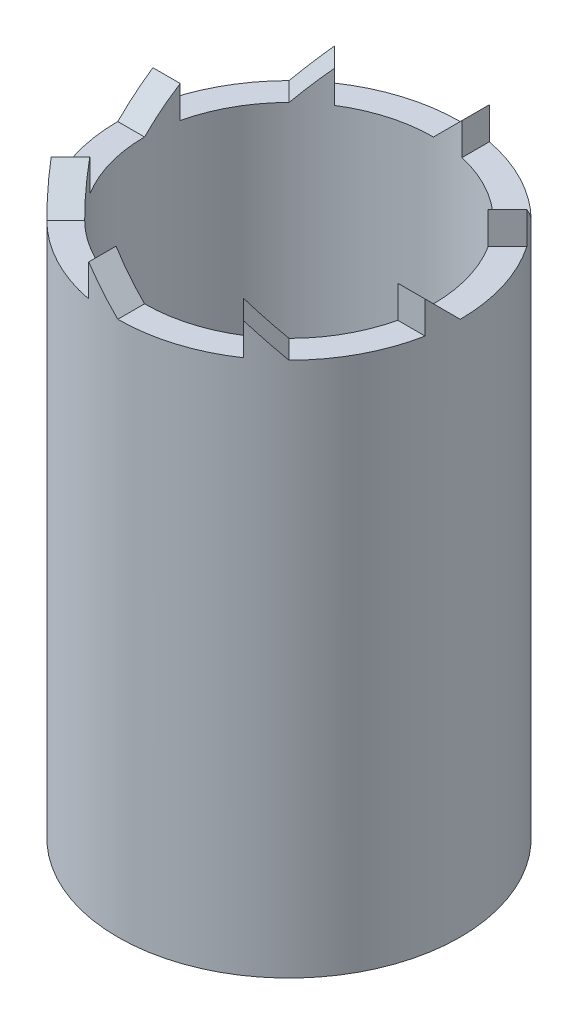
ISO-10303-21;
HEADER;
FILE_DESCRIPTION(('STEP AP214'),'2;1');
FILE_NAME('part.step','',(''),(''),'','','');
FILE_SCHEMA(('AUTOMOTIVE_DESIGN { 1 0 10303 214 1 1 1 1 }'));
ENDSEC;
DATA;
#1=APPLICATION_CONTEXT('core data for automotive mechanical design processes');
#2=APPLICATION_PROTOCOL_DEFINITION('international standard','automotive_design',2000,#1);
#3=PRODUCT_CONTEXT('',#1,'mechanical');
#4=PRODUCT('Part','Part','',(#3));
#5=PRODUCT_RELATED_PRODUCT_CATEGORY('part','',(#4));
#6=PRODUCT_DEFINITION_FORMATION('','',#4);
#7=PRODUCT_DEFINITION_CONTEXT('part definition',#1,'design');
#8=PRODUCT_DEFINITION('design','',#6,#7);
#9=PRODUCT_DEFINITION_SHAPE('','',#8);
#10=(LENGTH_UNIT() NAMED_UNIT(*) SI_UNIT(.MILLI.,.METRE.));
#11=(NAMED_UNIT(*) PLANE_ANGLE_UNIT() SI_UNIT($,.RADIAN.));
#12=(NAMED_UNIT(*) SI_UNIT($,.STERADIAN.) SOLID_ANGLE_UNIT());
#13=UNCERTAINTY_MEASURE_WITH_UNIT(LENGTH_MEASURE(1.E-05),#10,'distance_accuracy_value','');
#14=(GEOMETRIC_REPRESENTATION_CONTEXT(3) GLOBAL_UNCERTAINTY_ASSIGNED_CONTEXT((#13)) GLOBAL_UNIT_ASSIGNED_CONTEXT((#10,
#11,#12)) REPRESENTATION_CONTEXT('',''));
#15=CARTESIAN_POINT('',(0.,0.,0.));
#16=DIRECTION('',(0.,0.,1.));
#17=DIRECTION('',(1.,0.,0.));
#18=AXIS2_PLACEMENT_3D('',#15,#16,#17);
#19=CARTESIAN_POINT('',(-1.5,26.5,8.25));
#20=DIRECTION('',(1.,0.,0.));
#21=DIRECTION('',(0.,0.,-1.));
#22=AXIS2_PLACEMENT_3D('',#19,#20,#21);
#23=PLANE('',#22);
#24=DIRECTION('',(0.,-1.,0.));
#25=VECTOR('',#24,1.);
#26=CARTESIAN_POINT('',(-1.5,40.,6.5812232905441));
#27=LINE('',#26,#25);
#28=CARTESIAN_POINT('',(-1.5,25.,6.5812232905441));
#29=VERTEX_POINT('',#28);
#30=CARTESIAN_POINT('',(-1.5,26.5,6.5812232905441));
#31=VERTEX_POINT('',#30);
#32=EDGE_CURVE('E364',#29,#31,#27,.F.);
#33=ORIENTED_EDGE('',*,*,#32,.F.);
#34=DIRECTION('',(0.,0.,1.));
#35=VECTOR('',#34,1.);
#36=CARTESIAN_POINT('',(-1.5,25.,8.25));
#37=LINE('',#36,#35);
#38=CARTESIAN_POINT('',(-1.5,25.,7.85811682275086));
#39=VERTEX_POINT('',#38);
#40=EDGE_CURVE('E47',#29,#39,#37,.T.);
#41=ORIENTED_EDGE('',*,*,#40,.T.);
#42=DIRECTION('',(0.,-1.,0.));
#43=VECTOR('',#42,1.);
#44=CARTESIAN_POINT('',(-1.5,35.,7.85811682275086));
#45=LINE('',#44,#43);
#46=CARTESIAN_POINT('',(-1.5,26.5,7.85811682275086));
#47=VERTEX_POINT('',#46);
#48=EDGE_CURVE('E347',#47,#39,#45,.T.);
#49=ORIENTED_EDGE('',*,*,#48,.F.);
#50=DIRECTION('',(0.,0.,1.));
#51=VECTOR('',#50,1.);
#52=CARTESIAN_POINT('',(-1.5,26.5,8.25));
#53=LINE('',#52,#51);
#54=EDGE_CURVE('E250',#31,#47,#53,.T.);
#55=ORIENTED_EDGE('',*,*,#54,.F.);
#56=EDGE_LOOP('',(#33,#41,#49,#55));
#57=FACE_BOUND('',#56,.T.);
#58=ADVANCED_FACE('F39',(#57),#23,.F.);
#59=CARTESIAN_POINT('',(1.5,26.5,-8.25));
#60=DIRECTION('',(-1.,0.,0.));
#61=DIRECTION('',(0.,0.,1.));
#62=AXIS2_PLACEMENT_3D('',#59,#60,#61);
#63=PLANE('',#62);
#64=DIRECTION('',(0.,-1.,0.));
#65=VECTOR('',#64,1.);
#66=CARTESIAN_POINT('',(1.5,40.,-6.5812232905441));
#67=LINE('',#66,#65);
#68=CARTESIAN_POINT('',(1.5,25.,-6.5812232905441));
#69=VERTEX_POINT('',#68);
#70=CARTESIAN_POINT('',(1.5,26.5,-6.5812232905441));
#71=VERTEX_POINT('',#70);
#72=EDGE_CURVE('E368',#69,#71,#67,.F.);
#73=ORIENTED_EDGE('',*,*,#72,.F.);
#74=DIRECTION('',(0.,0.,-1.));
#75=VECTOR('',#74,1.);
#76=CARTESIAN_POINT('',(1.5,25.,-8.25));
#77=LINE('',#76,#75);
#78=CARTESIAN_POINT('',(1.5,25.,-7.85811682275085));
#79=VERTEX_POINT('',#78);
#80=EDGE_CURVE('E254',#69,#79,#77,.T.);
#81=ORIENTED_EDGE('',*,*,#80,.T.);
#82=DIRECTION('',(0.,-1.,0.));
#83=VECTOR('',#82,1.);
#84=CARTESIAN_POINT('',(1.5,35.,-7.85811682275086));
#85=LINE('',#84,#83);
#86=CARTESIAN_POINT('',(1.5,26.5,-7.85811682275086));
#87=VERTEX_POINT('',#86);
#88=EDGE_CURVE('E302',#87,#79,#85,.T.);
#89=ORIENTED_EDGE('',*,*,#88,.F.);
#90=DIRECTION('',(0.,0.,-1.));
#91=VECTOR('',#90,1.);
#92=CARTESIAN_POINT('',(1.5,26.5,-8.25));
#93=LINE('',#92,#91);
#94=EDGE_CURVE('E251',#71,#87,#93,.T.);
#95=ORIENTED_EDGE('',*,*,#94,.F.);
#96=EDGE_LOOP('',(#73,#81,#89,#95));
#97=FACE_BOUND('',#96,.T.);
#98=ADVANCED_FACE('F399',(#97),#63,.F.);
#99=CARTESIAN_POINT('',(-8.25,26.5,-1.4996220710507));
#100=DIRECTION('',(0.,0.,1.));
#101=DIRECTION('',(1.,0.,0.));
#102=AXIS2_PLACEMENT_3D('',#99,#100,#101);
#103=PLANE('',#102);
#104=DIRECTION('',(0.,-1.,0.));
#105=VECTOR('',#104,1.);
#106=CARTESIAN_POINT('',(-6.58130941713104,40.,-1.4996220710507));
#107=LINE('',#106,#105);
#108=CARTESIAN_POINT('',(-6.58130941713104,25.,-1.4996220710507));
#109=VERTEX_POINT('',#108);
#110=CARTESIAN_POINT('',(-6.58130941713104,26.5,-1.4996220710507));
#111=VERTEX_POINT('',#110);
#112=EDGE_CURVE('E374',#109,#111,#107,.F.);
#113=ORIENTED_EDGE('',*,*,#112,.F.);
#114=DIRECTION('',(-1.,0.,0.));
#115=VECTOR('',#114,1.);
#116=CARTESIAN_POINT('',(-8.25,25.,-1.4996220710507));
#117=LINE('',#116,#115);
#118=CARTESIAN_POINT('',(-7.8581889544613,25.,-1.4996220710507));
#119=VERTEX_POINT('',#118);
#120=EDGE_CURVE('E262',#109,#119,#117,.T.);
#121=ORIENTED_EDGE('',*,*,#120,.T.);
#122=DIRECTION('',(0.,-1.,0.));
#123=VECTOR('',#122,1.);
#124=CARTESIAN_POINT('',(-7.8581889544613,35.,-1.4996220710507));
#125=LINE('',#124,#123);
#126=CARTESIAN_POINT('',(-7.85818895446131,26.5,-1.4996220710507));
#127=VERTEX_POINT('',#126);
#128=EDGE_CURVE('E325',#127,#119,#125,.T.);
#129=ORIENTED_EDGE('',*,*,#128,.F.);
#130=DIRECTION('',(-1.,0.,0.));
#131=VECTOR('',#130,1.);
#132=CARTESIAN_POINT('',(-8.25,26.5,-1.4996220710507));
#133=LINE('',#132,#131);
#134=EDGE_CURVE('E260',#111,#127,#133,.T.);
#135=ORIENTED_EDGE('',*,*,#134,.F.);
#136=EDGE_LOOP('',(#113,#121,#129,#135));
#137=FACE_BOUND('',#136,.T.);
#138=ADVANCED_FACE('F422',(#137),#103,.F.);
#139=CARTESIAN_POINT('',(8.25,26.5,1.5));
#140=DIRECTION('',(0.,0.,-1.));
#141=DIRECTION('',(-1.,0.,0.));
#142=AXIS2_PLACEMENT_3D('',#139,#140,#141);
#143=PLANE('',#142);
#144=DIRECTION('',(0.,-1.,0.));
#145=VECTOR('',#144,1.);
#146=CARTESIAN_POINT('',(6.5812232905441,40.,1.5));
#147=LINE('',#146,#145);
#148=CARTESIAN_POINT('',(6.5812232905441,25.,1.5));
#149=VERTEX_POINT('',#148);
#150=CARTESIAN_POINT('',(6.5812232905441,26.5,1.5));
#151=VERTEX_POINT('',#150);
#152=EDGE_CURVE('E386',#149,#151,#147,.F.);
#153=ORIENTED_EDGE('',*,*,#152,.F.);
#154=DIRECTION('',(1.,0.,0.));
#155=VECTOR('',#154,1.);
#156=CARTESIAN_POINT('',(8.25,25.,1.5));
#157=LINE('',#156,#155);
#158=CARTESIAN_POINT('',(7.85811682275085,25.,1.5));
#159=VERTEX_POINT('',#158);
#160=EDGE_CURVE('E270',#149,#159,#157,.T.);
#161=ORIENTED_EDGE('',*,*,#160,.T.);
#162=DIRECTION('',(0.,-1.,0.));
#163=VECTOR('',#162,1.);
#164=CARTESIAN_POINT('',(7.85811682275086,35.,1.5));
#165=LINE('',#164,#163);
#166=CARTESIAN_POINT('',(7.85811682275086,26.5,1.5));
#167=VERTEX_POINT('',#166);
#168=EDGE_CURVE('E349',#167,#159,#165,.T.);
#169=ORIENTED_EDGE('',*,*,#168,.F.);
#170=DIRECTION('',(1.,0.,0.));
#171=VECTOR('',#170,1.);
#172=CARTESIAN_POINT('',(8.25,26.5,1.5));
#173=LINE('',#172,#171);
#174=EDGE_CURVE('E268',#151,#167,#173,.T.);
#175=ORIENTED_EDGE('',*,*,#174,.F.);
#176=EDGE_LOOP('',(#153,#161,#169,#175));
#177=FACE_BOUND('',#176,.T.);
#178=ADVANCED_FACE('F471',(#177),#143,.F.);
#179=CARTESIAN_POINT('',(-4.77297077300919,26.5,-6.89429111656883));
#180=DIRECTION('',(-0.70710678118655,0.,0.707106781186546));
#181=DIRECTION('',(0.707106781186546,0.,0.70710678118655));
#182=AXIS2_PLACEMENT_3D('',#179,#180,#181);
#183=PLANE('',#182);
#184=DIRECTION('',(0.,-1.,0.));
#185=VECTOR('',#184,1.);
#186=CARTESIAN_POINT('',(-3.59296744546676,40.,-5.71428778902639));
#187=LINE('',#186,#185);
#188=CARTESIAN_POINT('',(-3.59296744546676,25.,-5.71428778902639));
#189=VERTEX_POINT('',#188);
#190=CARTESIAN_POINT('',(-3.59296744546676,26.5,-5.71428778902639));
#191=VERTEX_POINT('',#190);
#192=EDGE_CURVE('E372',#189,#191,#187,.F.);
#193=ORIENTED_EDGE('',*,*,#192,.F.);
#194=DIRECTION('',(-0.707106781186545,0.,-0.707106781186549));
#195=VECTOR('',#194,1.);
#196=CARTESIAN_POINT('',(-4.77297077300919,25.,-6.89429111656883));
#197=LINE('',#196,#195);
#198=CARTESIAN_POINT('',(-4.4958675209434,25.,-6.61718786450304));
#199=VERTEX_POINT('',#198);
#200=EDGE_CURVE('E277',#189,#199,#197,.T.);
#201=ORIENTED_EDGE('',*,*,#200,.T.);
#202=DIRECTION('',(0.,-1.,0.));
#203=VECTOR('',#202,1.);
#204=CARTESIAN_POINT('',(-4.4958675209434,35.,-6.61718786450304));
#205=LINE('',#204,#203);
#206=CARTESIAN_POINT('',(-4.4958675209434,26.5,-6.61718786450304));
#207=VERTEX_POINT('',#206);
#208=EDGE_CURVE('E314',#207,#199,#205,.T.);
#209=ORIENTED_EDGE('',*,*,#208,.F.);
#210=DIRECTION('',(-0.707106781186545,0.,-0.707106781186549));
#211=VECTOR('',#210,1.);
#212=CARTESIAN_POINT('',(-4.77297077300919,26.5,-6.89429111656883));
#213=LINE('',#212,#211);
#214=EDGE_CURVE('E275',#191,#207,#213,.T.);
#215=ORIENTED_EDGE('',*,*,#214,.F.);
#216=EDGE_LOOP('',(#193,#201,#209,#215));
#217=FACE_BOUND('',#216,.T.);
#218=ADVANCED_FACE('F411',(#217),#183,.F.);
#219=CARTESIAN_POINT('',(4.7729707730092,26.5,6.89429111656884));
#220=DIRECTION('',(0.707106781186548,0.,-0.707106781186547));
#221=DIRECTION('',(-0.707106781186547,0.,-0.707106781186548));
#222=AXIS2_PLACEMENT_3D('',#219,#220,#221);
#223=PLANE('',#222);
#224=DIRECTION('',(0.,-1.,0.));
#225=VECTOR('',#224,1.);
#226=CARTESIAN_POINT('',(3.59296744546676,40.,5.71428778902639));
#227=LINE('',#226,#225);
#228=CARTESIAN_POINT('',(3.59296744546676,25.,5.71428778902639));
#229=VERTEX_POINT('',#228);
#230=CARTESIAN_POINT('',(3.59296744546676,26.5,5.71428778902639));
#231=VERTEX_POINT('',#230);
#232=EDGE_CURVE('E384',#229,#231,#227,.F.);
#233=ORIENTED_EDGE('',*,*,#232,.F.);
#234=DIRECTION('',(0.707106781186547,0.,0.707106781186548));
#235=VECTOR('',#234,1.);
#236=CARTESIAN_POINT('',(4.7729707730092,25.,6.89429111656884));
#237=LINE('',#236,#235);
#238=CARTESIAN_POINT('',(4.4958675209434,25.,6.61718786450304));
#239=VERTEX_POINT('',#238);
#240=EDGE_CURVE('E285',#229,#239,#237,.T.);
#241=ORIENTED_EDGE('',*,*,#240,.T.);
#242=DIRECTION('',(0.,-1.,0.));
#243=VECTOR('',#242,1.);
#244=CARTESIAN_POINT('',(4.4958675209434,35.,6.61718786450304));
#245=LINE('',#244,#243);
#246=CARTESIAN_POINT('',(4.4958675209434,26.5,6.61718786450304));
#247=VERTEX_POINT('',#246);
#248=EDGE_CURVE('E358',#247,#239,#245,.T.);
#249=ORIENTED_EDGE('',*,*,#248,.F.);
#250=DIRECTION('',(0.707106781186547,0.,0.707106781186548));
#251=VECTOR('',#250,1.);
#252=CARTESIAN_POINT('',(4.7729707730092,26.5,6.89429111656884));
#253=LINE('',#252,#251);
#254=EDGE_CURVE('E283',#231,#247,#253,.T.);
#255=ORIENTED_EDGE('',*,*,#254,.F.);
#256=EDGE_LOOP('',(#233,#241,#249,#255));
#257=FACE_BOUND('',#256,.T.);
#258=ADVANCED_FACE('F477',(#257),#223,.F.);
#259=CARTESIAN_POINT('',(-6.89429111656884,26.5,4.77297077300919));
#260=DIRECTION('',(0.707106781186548,0.,0.707106781186547));
#261=DIRECTION('',(0.707106781186547,0.,-0.707106781186548));
#262=AXIS2_PLACEMENT_3D('',#259,#260,#261);
#263=PLANE('',#262);
#264=DIRECTION('',(0.,-1.,0.));
#265=VECTOR('',#264,1.);
#266=CARTESIAN_POINT('',(-5.7142877890264,40.,3.59296744546675));
#267=LINE('',#266,#265);
#268=CARTESIAN_POINT('',(-5.7142877890264,25.,3.59296744546675));
#269=VERTEX_POINT('',#268);
#270=CARTESIAN_POINT('',(-5.7142877890264,26.5,3.59296744546675));
#271=VERTEX_POINT('',#270);
#272=EDGE_CURVE('E378',#269,#271,#267,.F.);
#273=ORIENTED_EDGE('',*,*,#272,.F.);
#274=DIRECTION('',(-0.707106781186547,0.,0.707106781186548));
#275=VECTOR('',#274,1.);
#276=CARTESIAN_POINT('',(-6.89429111656884,25.,4.77297077300919));
#277=LINE('',#276,#275);
#278=CARTESIAN_POINT('',(-6.61718786450304,25.,4.49586752094339));
#279=VERTEX_POINT('',#278);
#280=EDGE_CURVE('E293',#269,#279,#277,.T.);
#281=ORIENTED_EDGE('',*,*,#280,.T.);
#282=DIRECTION('',(0.,-1.,0.));
#283=VECTOR('',#282,1.);
#284=CARTESIAN_POINT('',(-6.61718786450304,35.,4.49586752094339));
#285=LINE('',#284,#283);
#286=CARTESIAN_POINT('',(-6.61718786450304,26.5,4.49586752094339));
#287=VERTEX_POINT('',#286);
#288=EDGE_CURVE('E336',#287,#279,#285,.T.);
#289=ORIENTED_EDGE('',*,*,#288,.F.);
#290=DIRECTION('',(-0.707106781186547,0.,0.707106781186548));
#291=VECTOR('',#290,1.);
#292=CARTESIAN_POINT('',(-6.89429111656884,26.5,4.77297077300919));
#293=LINE('',#292,#291);
#294=EDGE_CURVE('E291',#271,#287,#293,.T.);
#295=ORIENTED_EDGE('',*,*,#294,.F.);
#296=EDGE_LOOP('',(#273,#281,#289,#295));
#297=FACE_BOUND('',#296,.T.);
#298=ADVANCED_FACE('F443',(#297),#263,.F.);
#299=CARTESIAN_POINT('',(6.89429111656884,26.5,-4.77297077300919));
#300=DIRECTION('',(-0.707106781186546,0.,-0.707106781186549));
#301=DIRECTION('',(-0.707106781186549,0.,0.707106781186546));
#302=AXIS2_PLACEMENT_3D('',#299,#300,#301);
#303=PLANE('',#302);
#304=DIRECTION('',(0.,-1.,0.));
#305=VECTOR('',#304,1.);
#306=CARTESIAN_POINT('',(5.7142877890264,40.,-3.59296744546675));
#307=LINE('',#306,#305);
#308=CARTESIAN_POINT('',(5.7142877890264,25.,-3.59296744546675));
#309=VERTEX_POINT('',#308);
#310=CARTESIAN_POINT('',(5.7142877890264,26.5,-3.59296744546675));
#311=VERTEX_POINT('',#310);
#312=EDGE_CURVE('E201',#309,#311,#307,.F.);
#313=ORIENTED_EDGE('',*,*,#312,.F.);
#314=DIRECTION('',(0.707106781186549,0.,-0.707106781186546));
#315=VECTOR('',#314,1.);
#316=CARTESIAN_POINT('',(6.89429111656884,25.,-4.77297077300919));
#317=LINE('',#316,#315);
#318=CARTESIAN_POINT('',(6.61718786450304,25.,-4.49586752094339));
#319=VERTEX_POINT('',#318);
#320=EDGE_CURVE('E205',#309,#319,#317,.T.);
#321=ORIENTED_EDGE('',*,*,#320,.T.);
#322=DIRECTION('',(0.,-1.,0.));
#323=VECTOR('',#322,1.);
#324=CARTESIAN_POINT('',(6.61718786450304,35.,-4.49586752094339));
#325=LINE('',#324,#323);
#326=CARTESIAN_POINT('',(6.61718786450304,26.5,-4.49586752094339));
#327=VERTEX_POINT('',#326);
#328=EDGE_CURVE('E327',#327,#319,#325,.T.);
#329=ORIENTED_EDGE('',*,*,#328,.F.);
#330=DIRECTION('',(0.707106781186549,0.,-0.707106781186546));
#331=VECTOR('',#330,1.);
#332=CARTESIAN_POINT('',(6.89429111656884,26.5,-4.77297077300919));
#333=LINE('',#332,#331);
#334=EDGE_CURVE('E206',#311,#327,#333,.T.);
#335=ORIENTED_EDGE('',*,*,#334,.F.);
#336=EDGE_LOOP('',(#313,#321,#329,#335));
#337=FACE_BOUND('',#336,.T.);
#338=ADVANCED_FACE('F203',(#337),#303,.F.);
#339=CARTESIAN_POINT('',(-1.5,26.5,5.75));
#340=DIRECTION('',(-0.707106781186548,-0.707106781186547,0.));
#341=DIRECTION('',(0.707106781186547,-0.707106781186548,0.));
#342=AXIS2_PLACEMENT_3D('',#339,#340,#341);
#343=PLANE('',#342);
#344=CARTESIAN_POINT('',(0.,25.,0.));
#345=DIRECTION('',(-0.707106781186548,-0.707106781186547,0.));
#346=DIRECTION('',(0.707106781186547,-0.707106781186548,0.));
#347=AXIS2_PLACEMENT_3D('',#344,#345,#346);
#348=ELLIPSE('',#347,9.5459415460184,6.75);
#349=CARTESIAN_POINT('',(0.,25.,6.75));
#350=VERTEX_POINT('',#349);
#351=EDGE_CURVE('E61',#31,#350,#348,.F.);
#352=ORIENTED_EDGE('',*,*,#351,.F.);
#353=ORIENTED_EDGE('',*,*,#54,.T.);
#354=CARTESIAN_POINT('',(0.,25.,0.));
#355=DIRECTION('',(-0.707106781186548,-0.707106781186547,0.));
#356=DIRECTION('',(0.707106781186547,-0.707106781186548,0.));
#357=AXIS2_PLACEMENT_3D('',#354,#355,#356);
#358=ELLIPSE('',#357,11.3137084989848,8.);
#359=CARTESIAN_POINT('',(0.,25.,8.));
#360=VERTEX_POINT('',#359);
#361=EDGE_CURVE('E351',#360,#47,#358,.T.);
#362=ORIENTED_EDGE('',*,*,#361,.F.);
#363=DIRECTION('',(0.,0.,-1.));
#364=VECTOR('',#363,1.);
#365=CARTESIAN_POINT('',(0.,25.,8.25));
#366=LINE('',#365,#364);
#367=EDGE_CURVE('E248',#360,#350,#366,.T.);
#368=ORIENTED_EDGE('',*,*,#367,.T.);
#369=EDGE_LOOP('',(#352,#353,#362,#368));
#370=FACE_BOUND('',#369,.T.);
#371=ADVANCED_FACE('F485',(#370),#343,.F.);
#372=CARTESIAN_POINT('',(-5.75,26.5,-1.4996220710507));
#373=DIRECTION('',(0.,-0.707017685644095,-0.707195865504364));
#374=DIRECTION('',(0.,0.707195865504364,-0.707017685644095));
#375=AXIS2_PLACEMENT_3D('',#372,#373,#374);
#376=PLANE('',#375);
#377=CARTESIAN_POINT('',(0.,25.,0.));
#378=DIRECTION('',(0.,-0.707017685644095,-0.707195865504364));
#379=DIRECTION('',(0.,-0.707195865504364,0.707017685644095));
#380=AXIS2_PLACEMENT_3D('',#377,#378,#379);
#381=ELLIPSE('',#380,9.54714448741227,6.75);
#382=CARTESIAN_POINT('',(-6.75,25.,0.));
#383=VERTEX_POINT('',#382);
#384=EDGE_CURVE('E376',#111,#383,#381,.F.);
#385=ORIENTED_EDGE('',*,*,#384,.F.);
#386=ORIENTED_EDGE('',*,*,#134,.T.);
#387=CARTESIAN_POINT('',(0.,25.,0.));
#388=DIRECTION('',(0.,-0.707017685644095,-0.707195865504364));
#389=DIRECTION('',(0.,-0.707195865504364,0.707017685644095));
#390=AXIS2_PLACEMENT_3D('',#387,#388,#389);
#391=ELLIPSE('',#390,11.3151342073034,8.);
#392=CARTESIAN_POINT('',(-8.,25.,0.));
#393=VERTEX_POINT('',#392);
#394=EDGE_CURVE('E329',#393,#127,#391,.T.);
#395=ORIENTED_EDGE('',*,*,#394,.F.);
#396=DIRECTION('',(1.,0.,0.));
#397=VECTOR('',#396,1.);
#398=CARTESIAN_POINT('',(-8.25,25.,0.));
#399=LINE('',#398,#397);
#400=EDGE_CURVE('E265',#393,#383,#399,.T.);
#401=ORIENTED_EDGE('',*,*,#400,.T.);
#402=EDGE_LOOP('',(#385,#386,#395,#401));
#403=FACE_BOUND('',#402,.T.);
#404=ADVANCED_FACE('F426',(#403),#376,.F.);
#405=CARTESIAN_POINT('',(1.5,26.5,-5.75));
#406=DIRECTION('',(0.707106781186548,-0.707106781186547,0.));
#407=DIRECTION('',(0.707106781186547,0.707106781186548,0.));
#408=AXIS2_PLACEMENT_3D('',#405,#406,#407);
#409=PLANE('',#408);
#410=CARTESIAN_POINT('',(0.,25.,0.));
#411=DIRECTION('',(0.707106781186548,-0.707106781186547,0.));
#412=DIRECTION('',(-0.707106781186547,-0.707106781186548,0.));
#413=AXIS2_PLACEMENT_3D('',#410,#411,#412);
#414=ELLIPSE('',#413,9.5459415460184,6.75);
#415=CARTESIAN_POINT('',(0.,25.,-6.75));
#416=VERTEX_POINT('',#415);
#417=EDGE_CURVE('E366',#71,#416,#414,.F.);
#418=ORIENTED_EDGE('',*,*,#417,.F.);
#419=ORIENTED_EDGE('',*,*,#94,.T.);
#420=CARTESIAN_POINT('',(0.,25.,0.));
#421=DIRECTION('',(0.707106781186548,-0.707106781186547,0.));
#422=DIRECTION('',(-0.707106781186547,-0.707106781186548,0.));
#423=AXIS2_PLACEMENT_3D('',#420,#421,#422);
#424=ELLIPSE('',#423,11.3137084989848,8.);
#425=CARTESIAN_POINT('',(0.,25.,-8.));
#426=VERTEX_POINT('',#425);
#427=EDGE_CURVE('E305',#426,#87,#424,.T.);
#428=ORIENTED_EDGE('',*,*,#427,.F.);
#429=DIRECTION('',(0.,0.,1.));
#430=VECTOR('',#429,1.);
#431=CARTESIAN_POINT('',(0.,25.,-8.25));
#432=LINE('',#431,#430);
#433=EDGE_CURVE('E257',#426,#416,#432,.T.);
#434=ORIENTED_EDGE('',*,*,#433,.T.);
#435=EDGE_LOOP('',(#418,#419,#428,#434));
#436=FACE_BOUND('',#435,.T.);
#437=ADVANCED_FACE('F403',(#436),#409,.F.);
#438=CARTESIAN_POINT('',(5.75,25.,0.));
#439=DIRECTION('',(0.,-0.707106781186547,0.707106781186548));
#440=DIRECTION('',(0.,-0.707106781186548,-0.707106781186547));
#441=AXIS2_PLACEMENT_3D('',#438,#439,#440);
#442=PLANE('',#441);
#443=CARTESIAN_POINT('',(0.,25.,0.));
#444=DIRECTION('',(0.,-0.707106781186547,0.707106781186548));
#445=DIRECTION('',(0.,-0.707106781186548,-0.707106781186547));
#446=AXIS2_PLACEMENT_3D('',#443,#444,#445);
#447=ELLIPSE('',#446,9.5459415460184,6.75);
#448=CARTESIAN_POINT('',(6.75,25.,0.));
#449=VERTEX_POINT('',#448);
#450=EDGE_CURVE('E209',#151,#449,#447,.F.);
#451=ORIENTED_EDGE('',*,*,#450,.F.);
#452=ORIENTED_EDGE('',*,*,#174,.T.);
#453=CARTESIAN_POINT('',(0.,25.,0.));
#454=DIRECTION('',(0.,-0.707106781186547,0.707106781186548));
#455=DIRECTION('',(0.,-0.707106781186548,-0.707106781186547));
#456=AXIS2_PLACEMENT_3D('',#453,#454,#455);
#457=ELLIPSE('',#456,11.3137084989848,8.);
#458=CARTESIAN_POINT('',(8.,25.,0.));
#459=VERTEX_POINT('',#458);
#460=EDGE_CURVE('E341',#459,#167,#457,.T.);
#461=ORIENTED_EDGE('',*,*,#460,.F.);
#462=DIRECTION('',(-1.,0.,0.));
#463=VECTOR('',#462,1.);
#464=CARTESIAN_POINT('',(8.25,25.,0.));
#465=LINE('',#464,#463);
#466=EDGE_CURVE('E273',#459,#449,#465,.T.);
#467=ORIENTED_EDGE('',*,*,#466,.T.);
#468=EDGE_LOOP('',(#451,#452,#461,#467));
#469=FACE_BOUND('',#468,.T.);
#470=ADVANCED_FACE('F493',(#469),#442,.F.);
#471=CARTESIAN_POINT('',(0.,25.,0.));
#472=DIRECTION('',(0.,1.,0.));
#473=DIRECTION('',(0.,0.,1.));
#474=AXIS2_PLACEMENT_3D('',#471,#472,#473);
#475=PLANE('',#474);
#476=DIRECTION('',(-0.707106781186548,0.,0.707106781186547));
#477=VECTOR('',#476,1.);
#478=CARTESIAN_POINT('',(4.59619407771257,25.,-4.59619407771255));
#479=LINE('',#478,#477);
#480=CARTESIAN_POINT('',(5.65685424949239,25.,-5.65685424949237));
#481=VERTEX_POINT('',#480);
#482=CARTESIAN_POINT('',(4.7729707730092,25.,-4.77297077300918));
#483=VERTEX_POINT('',#482);
#484=EDGE_CURVE('E219',#481,#483,#479,.T.);
#485=ORIENTED_EDGE('',*,*,#484,.F.);
#486=CARTESIAN_POINT('',(0.,25.,0.));
#487=DIRECTION('',(0.,1.,0.));
#488=DIRECTION('',(0.,0.,1.));
#489=AXIS2_PLACEMENT_3D('',#486,#487,#488);
#490=CIRCLE('',#489,8.);
#491=EDGE_CURVE('E308',#481,#79,#490,.T.);
#492=ORIENTED_EDGE('',*,*,#491,.T.);
#493=ORIENTED_EDGE('',*,*,#80,.F.);
#494=CARTESIAN_POINT('',(0.,25.,0.));
#495=DIRECTION('',(0.,1.,0.));
#496=DIRECTION('',(0.,0.,1.));
#497=AXIS2_PLACEMENT_3D('',#494,#495,#496);
#498=CIRCLE('',#497,6.75);
#499=EDGE_CURVE('E226',#483,#69,#498,.T.);
#500=ORIENTED_EDGE('',*,*,#499,.F.);
#501=EDGE_LOOP('',(#485,#492,#493,#500));
#502=FACE_BOUND('',#501,.T.);
#503=ADVANCED_FACE('F396',(#502),#475,.T.);
#504=ORIENTED_EDGE('',*,*,#466,.F.);
#505=CARTESIAN_POINT('',(0.,25.,0.));
#506=DIRECTION('',(0.,1.,0.));
#507=DIRECTION('',(0.,0.,1.));
#508=AXIS2_PLACEMENT_3D('',#505,#506,#507);
#509=CIRCLE('',#508,8.);
#510=EDGE_CURVE('E218',#459,#319,#509,.T.);
#511=ORIENTED_EDGE('',*,*,#510,.T.);
#512=ORIENTED_EDGE('',*,*,#320,.F.);
#513=EDGE_CURVE('E217',#449,#309,#498,.T.);
#514=ORIENTED_EDGE('',*,*,#513,.F.);
#515=EDGE_LOOP('',(#504,#511,#512,#514));
#516=FACE_BOUND('',#515,.T.);
#517=ADVANCED_FACE('F216',(#516),#475,.T.);
#518=DIRECTION('',(0.707106781186549,0.,-0.707106781186546));
#519=VECTOR('',#518,1.);
#520=CARTESIAN_POINT('',(-4.59619407771257,25.,4.59619407771255));
#521=LINE('',#520,#519);
#522=CARTESIAN_POINT('',(-5.65685424949239,25.,5.65685424949237));
#523=VERTEX_POINT('',#522);
#524=CARTESIAN_POINT('',(-4.77297077300921,25.,4.77297077300918));
#525=VERTEX_POINT('',#524);
#526=EDGE_CURVE('E296',#523,#525,#521,.T.);
#527=ORIENTED_EDGE('',*,*,#526,.F.);
#528=CARTESIAN_POINT('',(0.,25.,0.));
#529=DIRECTION('',(0.,1.,0.));
#530=DIRECTION('',(0.,0.,1.));
#531=AXIS2_PLACEMENT_3D('',#528,#529,#530);
#532=CIRCLE('',#531,8.);
#533=EDGE_CURVE('E344',#523,#39,#532,.T.);
#534=ORIENTED_EDGE('',*,*,#533,.T.);
#535=ORIENTED_EDGE('',*,*,#40,.F.);
#536=EDGE_CURVE('E232',#525,#29,#498,.T.);
#537=ORIENTED_EDGE('',*,*,#536,.F.);
#538=EDGE_LOOP('',(#527,#534,#535,#537));
#539=FACE_BOUND('',#538,.T.);
#540=ADVANCED_FACE('F446',(#539),#475,.T.);
#541=ORIENTED_EDGE('',*,*,#400,.F.);
#542=CARTESIAN_POINT('',(0.,25.,0.));
#543=DIRECTION('',(0.,1.,0.));
#544=DIRECTION('',(0.,0.,1.));
#545=AXIS2_PLACEMENT_3D('',#542,#543,#544);
#546=CIRCLE('',#545,8.);
#547=EDGE_CURVE('E333',#393,#279,#546,.T.);
#548=ORIENTED_EDGE('',*,*,#547,.T.);
#549=ORIENTED_EDGE('',*,*,#280,.F.);
#550=EDGE_CURVE('E228',#383,#269,#498,.T.);
#551=ORIENTED_EDGE('',*,*,#550,.F.);
#552=EDGE_LOOP('',(#541,#548,#549,#551));
#553=FACE_BOUND('',#552,.T.);
#554=ADVANCED_FACE('F432',(#553),#475,.T.);
#555=DIRECTION('',(-0.707106781186549,0.,-0.707106781186545));
#556=VECTOR('',#555,1.);
#557=CARTESIAN_POINT('',(4.59619407771256,25.,4.59619407771256));
#558=LINE('',#557,#556);
#559=CARTESIAN_POINT('',(5.65685424949238,25.,5.65685424949238));
#560=VERTEX_POINT('',#559);
#561=CARTESIAN_POINT('',(4.77297077300921,25.,4.7729707730092));
#562=VERTEX_POINT('',#561);
#563=EDGE_CURVE('E288',#560,#562,#558,.T.);
#564=ORIENTED_EDGE('',*,*,#563,.F.);
#565=CARTESIAN_POINT('',(0.,25.,0.));
#566=DIRECTION('',(0.,1.,0.));
#567=DIRECTION('',(0.,0.,1.));
#568=AXIS2_PLACEMENT_3D('',#565,#566,#567);
#569=CIRCLE('',#568,8.);
#570=EDGE_CURVE('E53',#560,#159,#569,.T.);
#571=ORIENTED_EDGE('',*,*,#570,.T.);
#572=ORIENTED_EDGE('',*,*,#160,.F.);
#573=EDGE_CURVE('E225',#562,#149,#498,.T.);
#574=ORIENTED_EDGE('',*,*,#573,.F.);
#575=EDGE_LOOP('',(#564,#571,#572,#574));
#576=FACE_BOUND('',#575,.T.);
#577=ADVANCED_FACE('F610',(#576),#475,.T.);
#578=ORIENTED_EDGE('',*,*,#367,.F.);
#579=CARTESIAN_POINT('',(0.,25.,0.));
#580=DIRECTION('',(0.,1.,0.));
#581=DIRECTION('',(0.,0.,1.));
#582=AXIS2_PLACEMENT_3D('',#579,#580,#581);
#583=CIRCLE('',#582,8.);
#584=EDGE_CURVE('E355',#360,#239,#583,.T.);
#585=ORIENTED_EDGE('',*,*,#584,.T.);
#586=ORIENTED_EDGE('',*,*,#240,.F.);
#587=EDGE_CURVE('E231',#350,#229,#498,.T.);
#588=ORIENTED_EDGE('',*,*,#587,.F.);
#589=EDGE_LOOP('',(#578,#585,#586,#588));
#590=FACE_BOUND('',#589,.T.);
#591=ADVANCED_FACE('F617',(#590),#475,.T.);
#592=DIRECTION('',(0.707106781186548,0.,0.707106781186548));
#593=VECTOR('',#592,1.);
#594=CARTESIAN_POINT('',(-4.59619407771256,25.,-4.59619407771256));
#595=LINE('',#594,#593);
#596=CARTESIAN_POINT('',(-5.65685424949238,25.,-5.65685424949238));
#597=VERTEX_POINT('',#596);
#598=CARTESIAN_POINT('',(-4.77297077300922,25.,-4.77297077300921));
#599=VERTEX_POINT('',#598);
#600=EDGE_CURVE('E280',#597,#599,#595,.T.);
#601=ORIENTED_EDGE('',*,*,#600,.F.);
#602=CARTESIAN_POINT('',(0.,25.,0.));
#603=DIRECTION('',(0.,1.,0.));
#604=DIRECTION('',(0.,0.,1.));
#605=AXIS2_PLACEMENT_3D('',#602,#603,#604);
#606=CIRCLE('',#605,8.);
#607=EDGE_CURVE('E322',#597,#119,#606,.T.);
#608=ORIENTED_EDGE('',*,*,#607,.T.);
#609=ORIENTED_EDGE('',*,*,#120,.F.);
#610=EDGE_CURVE('E229',#599,#109,#498,.T.);
#611=ORIENTED_EDGE('',*,*,#610,.F.);
#612=EDGE_LOOP('',(#601,#608,#609,#611));
#613=FACE_BOUND('',#612,.T.);
#614=ADVANCED_FACE('F419',(#613),#475,.T.);
#615=ORIENTED_EDGE('',*,*,#433,.F.);
#616=CARTESIAN_POINT('',(0.,25.,0.));
#617=DIRECTION('',(0.,1.,0.));
#618=DIRECTION('',(0.,0.,1.));
#619=AXIS2_PLACEMENT_3D('',#616,#617,#618);
#620=CIRCLE('',#619,8.);
#621=EDGE_CURVE('E311',#426,#199,#620,.T.);
#622=ORIENTED_EDGE('',*,*,#621,.T.);
#623=ORIENTED_EDGE('',*,*,#200,.F.);
#624=EDGE_CURVE('E234',#416,#189,#498,.T.);
#625=ORIENTED_EDGE('',*,*,#624,.F.);
#626=EDGE_LOOP('',(#615,#622,#623,#625));
#627=FACE_BOUND('',#626,.T.);
#628=ADVANCED_FACE('F408',(#627),#475,.T.);
#629=CARTESIAN_POINT('',(0.,0.,0.));
#630=DIRECTION('',(0.,1.,0.));
#631=DIRECTION('',(0.,0.,1.));
#632=AXIS2_PLACEMENT_3D('',#629,#630,#631);
#633=PLANE('',#632);
#634=CARTESIAN_POINT('',(0.,0.,0.));
#635=DIRECTION('',(0.,1.,0.));
#636=DIRECTION('',(0.,0.,1.));
#637=AXIS2_PLACEMENT_3D('',#634,#635,#636);
#638=CIRCLE('',#637,6.75);
#639=CARTESIAN_POINT('',(0.,0.,6.75));
#640=VERTEX_POINT('',#639);
#641=EDGE_CURVE('E253',#640,#640,#638,.T.);
#642=ORIENTED_EDGE('',*,*,#641,.T.);
#643=EDGE_LOOP('',(#642));
#644=FACE_BOUND('',#643,.T.);
#645=CARTESIAN_POINT('',(0.,0.,0.));
#646=DIRECTION('',(0.,-1.,0.));
#647=DIRECTION('',(0.,0.,-1.));
#648=AXIS2_PLACEMENT_3D('',#645,#646,#647);
#649=CIRCLE('',#648,8.);
#650=CARTESIAN_POINT('',(0.,0.,-8.));
#651=VERTEX_POINT('',#650);
#652=EDGE_CURVE('E360',#651,#651,#649,.T.);
#653=ORIENTED_EDGE('',*,*,#652,.T.);
#654=EDGE_LOOP('',(#653));
#655=FACE_BOUND('',#654,.T.);
#656=ADVANCED_FACE('F41',(#644,#655),#633,.F.);
#657=CARTESIAN_POINT('',(8.25,25.,-8.25));
#658=DIRECTION('',(-0.500000000000001,-0.707106781186545,-0.500000000000002));
#659=DIRECTION('',(0.,0.577350269189629,-0.816496580927724));
#660=AXIS2_PLACEMENT_3D('',#657,#658,#659);
#661=PLANE('',#660);
#662=CARTESIAN_POINT('',(0.,25.,0.));
#663=DIRECTION('',(-0.500000000000001,-0.707106781186545,-0.500000000000002));
#664=DIRECTION('',(0.499999999999998,-0.70710678118655,0.499999999999999));
#665=AXIS2_PLACEMENT_3D('',#662,#663,#664);
#666=ELLIPSE('',#665,9.54594154601843,6.75);
#667=EDGE_CURVE('E380',#271,#525,#666,.F.);
#668=ORIENTED_EDGE('',*,*,#667,.F.);
#669=ORIENTED_EDGE('',*,*,#294,.T.);
#670=CARTESIAN_POINT('',(0.,25.,0.));
#671=DIRECTION('',(-0.500000000000001,-0.707106781186545,-0.500000000000002));
#672=DIRECTION('',(0.499999999999998,-0.70710678118655,0.499999999999999));
#673=AXIS2_PLACEMENT_3D('',#670,#671,#672);
#674=ELLIPSE('',#673,11.3137084989848,8.);
#675=EDGE_CURVE('E338',#523,#287,#674,.T.);
#676=ORIENTED_EDGE('',*,*,#675,.F.);
#677=ORIENTED_EDGE('',*,*,#526,.T.);
#678=EDGE_LOOP('',(#668,#669,#676,#677));
#679=FACE_BOUND('',#678,.T.);
#680=ADVANCED_FACE('F438',(#679),#661,.F.);
#681=CARTESIAN_POINT('',(8.24999999999995,25.,8.25000000000005));
#682=DIRECTION('',(0.500000000000002,-0.707106781186547,-0.499999999999999));
#683=DIRECTION('',(0.816496580927724,0.577350269189628,0.));
#684=AXIS2_PLACEMENT_3D('',#681,#682,#683);
#685=PLANE('',#684);
#686=CARTESIAN_POINT('',(0.,25.,0.));
#687=DIRECTION('',(0.500000000000002,-0.707106781186547,-0.499999999999999));
#688=DIRECTION('',(-0.500000000000001,-0.707106781186548,0.499999999999998));
#689=AXIS2_PLACEMENT_3D('',#686,#687,#688);
#690=ELLIPSE('',#689,9.54594154601841,6.75);
#691=EDGE_CURVE('E370',#191,#599,#690,.F.);
#692=ORIENTED_EDGE('',*,*,#691,.F.);
#693=ORIENTED_EDGE('',*,*,#214,.T.);
#694=CARTESIAN_POINT('',(0.,25.,0.));
#695=DIRECTION('',(0.500000000000002,-0.707106781186547,-0.499999999999999));
#696=DIRECTION('',(-0.500000000000001,-0.707106781186548,0.499999999999998));
#697=AXIS2_PLACEMENT_3D('',#694,#695,#696);
#698=ELLIPSE('',#697,11.3137084989848,8.);
#699=EDGE_CURVE('E316',#597,#207,#698,.T.);
#700=ORIENTED_EDGE('',*,*,#699,.F.);
#701=ORIENTED_EDGE('',*,*,#600,.T.);
#702=EDGE_LOOP('',(#692,#693,#700,#701));
#703=FACE_BOUND('',#702,.T.);
#704=ADVANCED_FACE('F415',(#703),#685,.F.);
#705=CARTESIAN_POINT('',(-8.25,25.,8.25000000000001));
#706=DIRECTION('',(0.500000000000001,-0.707106781186546,0.500000000000001));
#707=DIRECTION('',(0.,-0.577350269189627,-0.816496580927725));
#708=AXIS2_PLACEMENT_3D('',#705,#706,#707);
#709=PLANE('',#708);
#710=CARTESIAN_POINT('',(0.,25.,0.));
#711=DIRECTION('',(0.500000000000001,-0.707106781186546,0.500000000000001));
#712=DIRECTION('',(-0.499999999999999,-0.707106781186549,-0.499999999999999));
#713=AXIS2_PLACEMENT_3D('',#710,#711,#712);
#714=ELLIPSE('',#713,9.54594154601842,6.75);
#715=EDGE_CURVE('E210',#311,#483,#714,.F.);
#716=ORIENTED_EDGE('',*,*,#715,.F.);
#717=ORIENTED_EDGE('',*,*,#334,.T.);
#718=CARTESIAN_POINT('',(0.,25.,0.));
#719=DIRECTION('',(0.500000000000001,-0.707106781186546,0.500000000000001));
#720=DIRECTION('',(-0.499999999999999,-0.707106781186549,-0.499999999999999));
#721=AXIS2_PLACEMENT_3D('',#718,#719,#720);
#722=ELLIPSE('',#721,11.3137084989848,8.);
#723=EDGE_CURVE('E319',#481,#327,#722,.T.);
#724=ORIENTED_EDGE('',*,*,#723,.F.);
#725=ORIENTED_EDGE('',*,*,#484,.T.);
#726=EDGE_LOOP('',(#716,#717,#724,#725));
#727=FACE_BOUND('',#726,.T.);
#728=ADVANCED_FACE('F394',(#727),#709,.F.);
#729=CARTESIAN_POINT('',(-8.24999999999998,25.,-8.25000000000002));
#730=DIRECTION('',(-0.500000000000001,-0.707106781186548,0.5));
#731=DIRECTION('',(0.816496580927726,-0.577350269189626,0.));
#732=AXIS2_PLACEMENT_3D('',#729,#730,#731);
#733=PLANE('',#732);
#734=CARTESIAN_POINT('',(0.,25.,0.));
#735=DIRECTION('',(-0.500000000000001,-0.707106781186548,0.5));
#736=DIRECTION('',(0.500000000000001,-0.707106781186547,-0.5));
#737=AXIS2_PLACEMENT_3D('',#734,#735,#736);
#738=ELLIPSE('',#737,9.5459415460184,6.75);
#739=EDGE_CURVE('E382',#231,#562,#738,.F.);
#740=ORIENTED_EDGE('',*,*,#739,.F.);
#741=ORIENTED_EDGE('',*,*,#254,.T.);
#742=CARTESIAN_POINT('',(0.,25.,0.));
#743=DIRECTION('',(-0.500000000000001,-0.707106781186548,0.5));
#744=DIRECTION('',(0.500000000000001,-0.707106781186547,-0.5));
#745=AXIS2_PLACEMENT_3D('',#742,#743,#744);
#746=ELLIPSE('',#745,11.3137084989848,8.);
#747=EDGE_CURVE('E11',#560,#247,#746,.T.);
#748=ORIENTED_EDGE('',*,*,#747,.F.);
#749=ORIENTED_EDGE('',*,*,#563,.T.);
#750=EDGE_LOOP('',(#740,#741,#748,#749));
#751=FACE_BOUND('',#750,.T.);
#752=ADVANCED_FACE('F452',(#751),#733,.F.);
#753=CARTESIAN_POINT('',(0.,25.,0.));
#754=DIRECTION('',(0.,-1.,0.));
#755=DIRECTION('',(0.,0.,-1.));
#756=AXIS2_PLACEMENT_3D('',#753,#754,#755);
#757=CYLINDRICAL_SURFACE('',#756,6.75);
#758=ORIENTED_EDGE('',*,*,#587,.T.);
#759=ORIENTED_EDGE('',*,*,#232,.T.);
#760=ORIENTED_EDGE('',*,*,#739,.T.);
#761=ORIENTED_EDGE('',*,*,#573,.T.);
#762=ORIENTED_EDGE('',*,*,#152,.T.);
#763=ORIENTED_EDGE('',*,*,#450,.T.);
#764=ORIENTED_EDGE('',*,*,#513,.T.);
#765=ORIENTED_EDGE('',*,*,#312,.T.);
#766=ORIENTED_EDGE('',*,*,#715,.T.);
#767=ORIENTED_EDGE('',*,*,#499,.T.);
#768=ORIENTED_EDGE('',*,*,#72,.T.);
#769=ORIENTED_EDGE('',*,*,#417,.T.);
#770=ORIENTED_EDGE('',*,*,#624,.T.);
#771=ORIENTED_EDGE('',*,*,#192,.T.);
#772=ORIENTED_EDGE('',*,*,#691,.T.);
#773=ORIENTED_EDGE('',*,*,#610,.T.);
#774=ORIENTED_EDGE('',*,*,#112,.T.);
#775=ORIENTED_EDGE('',*,*,#384,.T.);
#776=ORIENTED_EDGE('',*,*,#550,.T.);
#777=ORIENTED_EDGE('',*,*,#272,.T.);
#778=ORIENTED_EDGE('',*,*,#667,.T.);
#779=ORIENTED_EDGE('',*,*,#536,.T.);
#780=ORIENTED_EDGE('',*,*,#32,.T.);
#781=ORIENTED_EDGE('',*,*,#351,.T.);
#782=EDGE_LOOP('',(#758,#759,#760,#761,#762,#763,#764,#765,#766,#767,#768,#769,#770,#771,#772,
#773,#774,#775,#776,#777,#778,#779,#780,#781));
#783=FACE_BOUND('',#782,.T.);
#784=ORIENTED_EDGE('',*,*,#641,.F.);
#785=EDGE_LOOP('',(#784));
#786=FACE_BOUND('',#785,.T.);
#787=ADVANCED_FACE('F221',(#783,#786),#757,.F.);
#788=CARTESIAN_POINT('',(0.,35.,0.));
#789=DIRECTION('',(0.,-1.,0.));
#790=DIRECTION('',(0.,0.,-1.));
#791=AXIS2_PLACEMENT_3D('',#788,#789,#790);
#792=CYLINDRICAL_SURFACE('',#791,8.);
#793=ORIENTED_EDGE('',*,*,#652,.F.);
#794=EDGE_LOOP('',(#793));
#795=FACE_BOUND('',#794,.T.);
#796=ORIENTED_EDGE('',*,*,#88,.T.);
#797=ORIENTED_EDGE('',*,*,#491,.F.);
#798=ORIENTED_EDGE('',*,*,#723,.T.);
#799=ORIENTED_EDGE('',*,*,#328,.T.);
#800=ORIENTED_EDGE('',*,*,#510,.F.);
#801=ORIENTED_EDGE('',*,*,#460,.T.);
#802=ORIENTED_EDGE('',*,*,#168,.T.);
#803=ORIENTED_EDGE('',*,*,#570,.F.);
#804=ORIENTED_EDGE('',*,*,#747,.T.);
#805=ORIENTED_EDGE('',*,*,#248,.T.);
#806=ORIENTED_EDGE('',*,*,#584,.F.);
#807=ORIENTED_EDGE('',*,*,#361,.T.);
#808=ORIENTED_EDGE('',*,*,#48,.T.);
#809=ORIENTED_EDGE('',*,*,#533,.F.);
#810=ORIENTED_EDGE('',*,*,#675,.T.);
#811=ORIENTED_EDGE('',*,*,#288,.T.);
#812=ORIENTED_EDGE('',*,*,#547,.F.);
#813=ORIENTED_EDGE('',*,*,#394,.T.);
#814=ORIENTED_EDGE('',*,*,#128,.T.);
#815=ORIENTED_EDGE('',*,*,#607,.F.);
#816=ORIENTED_EDGE('',*,*,#699,.T.);
#817=ORIENTED_EDGE('',*,*,#208,.T.);
#818=ORIENTED_EDGE('',*,*,#621,.F.);
#819=ORIENTED_EDGE('',*,*,#427,.T.);
#820=EDGE_LOOP('',(#796,#797,#798,#799,#800,#801,#802,#803,#804,#805,#806,#807,#808,#809,#810,
#811,#812,#813,#814,#815,#816,#817,#818,#819));
#821=FACE_BOUND('',#820,.T.);
#822=ADVANCED_FACE('F444',(#795,#821),#792,.T.);
#823=CLOSED_SHELL('',(#58,#98,#138,#178,#218,#258,#298,#338,#371,#404,#437,#470,#503,#517,#540,
#554,#577,#591,#614,#628,#656,#680,#704,#728,#752,#787,#822));
#824=MANIFOLD_SOLID_BREP('B2',#823);
#825=ADVANCED_BREP_SHAPE_REPRESENTATION('',(#18,#824),#14);
#826=SHAPE_DEFINITION_REPRESENTATION(#9,#825);
ENDSEC;
END-ISO-10303-21;
